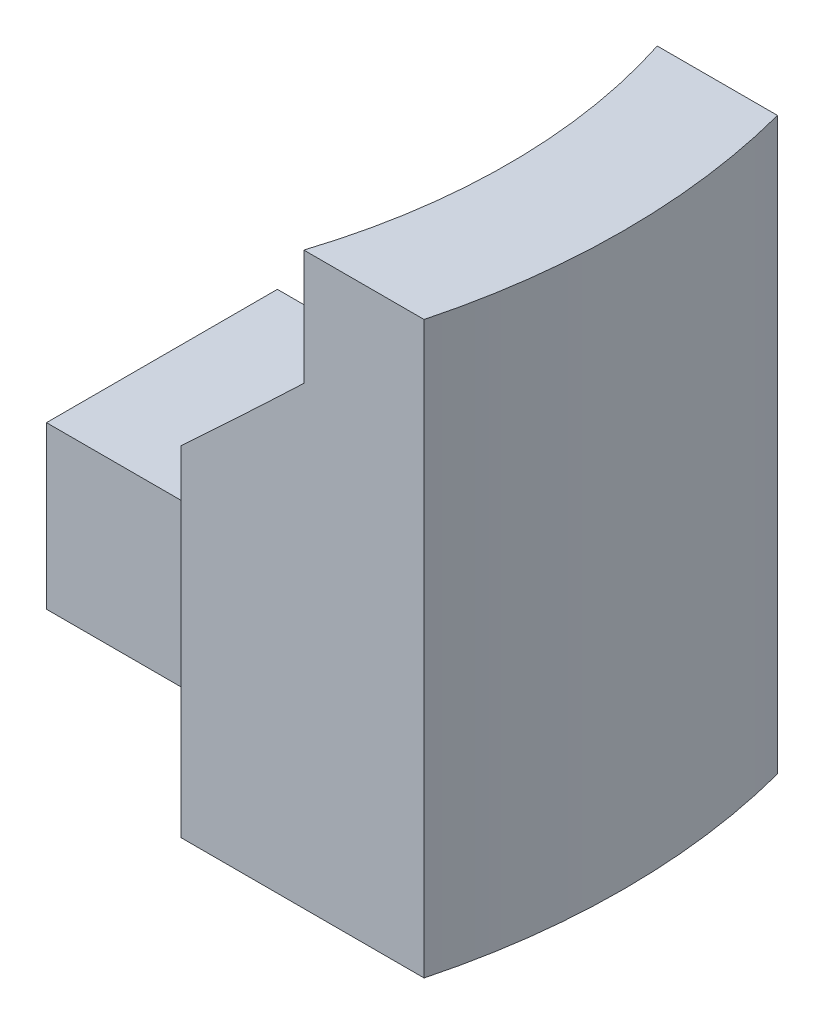
ISO-10303-21;
HEADER;
FILE_DESCRIPTION(('STEP AP214'),'2;1');
FILE_NAME('part.step','',(''),(''),'','','');
FILE_SCHEMA(('AUTOMOTIVE_DESIGN { 1 0 10303 214 1 1 1 1 }'));
ENDSEC;
DATA;
#1=APPLICATION_CONTEXT('core data for automotive mechanical design processes');
#2=APPLICATION_PROTOCOL_DEFINITION('international standard','automotive_design',2000,#1);
#3=PRODUCT_CONTEXT('',#1,'mechanical');
#4=PRODUCT('Part','Part','',(#3));
#5=PRODUCT_RELATED_PRODUCT_CATEGORY('part','',(#4));
#6=PRODUCT_DEFINITION_FORMATION('','',#4);
#7=PRODUCT_DEFINITION_CONTEXT('part definition',#1,'design');
#8=PRODUCT_DEFINITION('design','',#6,#7);
#9=PRODUCT_DEFINITION_SHAPE('','',#8);
#10=(LENGTH_UNIT() NAMED_UNIT(*) SI_UNIT(.MILLI.,.METRE.));
#11=(NAMED_UNIT(*) PLANE_ANGLE_UNIT() SI_UNIT($,.RADIAN.));
#12=(NAMED_UNIT(*) SI_UNIT($,.STERADIAN.) SOLID_ANGLE_UNIT());
#13=UNCERTAINTY_MEASURE_WITH_UNIT(LENGTH_MEASURE(1.E-05),#10,'distance_accuracy_value','');
#14=(GEOMETRIC_REPRESENTATION_CONTEXT(3) GLOBAL_UNCERTAINTY_ASSIGNED_CONTEXT((#13)) GLOBAL_UNIT_ASSIGNED_CONTEXT((#10,
#11,#12)) REPRESENTATION_CONTEXT('',''));
#15=CARTESIAN_POINT('',(0.,0.,0.));
#16=DIRECTION('',(0.,0.,1.));
#17=DIRECTION('',(1.,0.,0.));
#18=AXIS2_PLACEMENT_3D('',#15,#16,#17);
#19=CARTESIAN_POINT('',(-10.,0.,0.));
#20=DIRECTION('',(0.,-1.,0.));
#21=DIRECTION('',(0.,0.,-1.));
#22=AXIS2_PLACEMENT_3D('',#19,#20,#21);
#23=CYLINDRICAL_SURFACE('',#22,10.);
#24=DIRECTION('',(0.,-1.,0.));
#25=VECTOR('',#24,1.);
#26=CARTESIAN_POINT('',(-0.317541634481455,0.,2.5));
#27=LINE('',#26,#25);
#28=CARTESIAN_POINT('',(-0.317541634481455,1.5,2.5));
#29=VERTEX_POINT('',#28);
#30=CARTESIAN_POINT('',(-0.317541634481455,5.,2.5));
#31=VERTEX_POINT('',#30);
#32=EDGE_CURVE('E184',#29,#31,#27,.F.);
#33=ORIENTED_EDGE('',*,*,#32,.F.);
#34=CARTESIAN_POINT('',(-10.,-0.999999999999992,0.));
#35=DIRECTION('',(0.,0.707106781186549,-0.707106781186546));
#36=DIRECTION('',(0.,-0.707106781186546,-0.707106781186549));
#37=AXIS2_PLACEMENT_3D('',#34,#35,#36);
#38=ELLIPSE('',#37,14.1421356237309,10.);
#39=CARTESIAN_POINT('',(-0.0501256289337972,0.,0.999999999999996));
#40=VERTEX_POINT('',#39);
#41=EDGE_CURVE('E11',#29,#40,#38,.T.);
#42=ORIENTED_EDGE('',*,*,#41,.T.);
#43=CARTESIAN_POINT('',(-10.,0.,0.));
#44=DIRECTION('',(0.,-1.,0.));
#45=DIRECTION('',(0.,0.,-1.));
#46=AXIS2_PLACEMENT_3D('',#43,#44,#45);
#47=CIRCLE('',#46,10.);
#48=CARTESIAN_POINT('',(-0.761204674887133,0.,3.82683432365091));
#49=VERTEX_POINT('',#48);
#50=EDGE_CURVE('E248',#40,#49,#47,.T.);
#51=ORIENTED_EDGE('',*,*,#50,.T.);
#52=DIRECTION('',(0.,-1.,0.));
#53=VECTOR('',#52,1.);
#54=CARTESIAN_POINT('',(-0.761204674887134,7.35,3.82683432365091));
#55=LINE('',#54,#53);
#56=CARTESIAN_POINT('',(-0.761204674887134,7.35,3.82683432365091));
#57=VERTEX_POINT('',#56);
#58=EDGE_CURVE('E89',#57,#49,#55,.T.);
#59=ORIENTED_EDGE('',*,*,#58,.F.);
#60=CARTESIAN_POINT('',(-10.,7.35,0.));
#61=DIRECTION('',(0.,-1.,0.));
#62=DIRECTION('',(0.,0.,-1.));
#63=AXIS2_PLACEMENT_3D('',#60,#61,#62);
#64=CIRCLE('',#63,10.);
#65=CARTESIAN_POINT('',(-0.761204674887133,7.35,-3.82683432365091));
#66=VERTEX_POINT('',#65);
#67=EDGE_CURVE('E187',#66,#57,#64,.T.);
#68=ORIENTED_EDGE('',*,*,#67,.F.);
#69=DIRECTION('',(0.,-1.,0.));
#70=VECTOR('',#69,1.);
#71=CARTESIAN_POINT('',(-0.761204674887133,7.35,-3.82683432365091));
#72=LINE('',#71,#70);
#73=CARTESIAN_POINT('',(-0.761204674887132,0.,-3.82683432365091));
#74=VERTEX_POINT('',#73);
#75=EDGE_CURVE('E183',#66,#74,#72,.T.);
#76=ORIENTED_EDGE('',*,*,#75,.T.);
#77=CARTESIAN_POINT('',(-0.0501256289337972,0.,-1.));
#78=VERTEX_POINT('',#77);
#79=EDGE_CURVE('E249',#74,#78,#47,.T.);
#80=ORIENTED_EDGE('',*,*,#79,.T.);
#81=CARTESIAN_POINT('',(-10.,-1.,0.));
#82=DIRECTION('',(0.,0.707106781186546,0.707106781186549));
#83=DIRECTION('',(0.,-0.707106781186549,0.707106781186546));
#84=AXIS2_PLACEMENT_3D('',#81,#82,#83);
#85=ELLIPSE('',#84,14.142135623731,10.);
#86=CARTESIAN_POINT('',(-0.317541634481455,1.5,-2.5));
#87=VERTEX_POINT('',#86);
#88=EDGE_CURVE('E59',#78,#87,#85,.T.);
#89=ORIENTED_EDGE('',*,*,#88,.T.);
#90=DIRECTION('',(0.,-1.,0.));
#91=VECTOR('',#90,1.);
#92=CARTESIAN_POINT('',(-0.317541634481455,0.,-2.5));
#93=LINE('',#92,#91);
#94=CARTESIAN_POINT('',(-0.317541634481455,5.,-2.5));
#95=VERTEX_POINT('',#94);
#96=EDGE_CURVE('E148',#95,#87,#93,.T.);
#97=ORIENTED_EDGE('',*,*,#96,.F.);
#98=CARTESIAN_POINT('',(-10.,5.,0.));
#99=DIRECTION('',(0.,1.,0.));
#100=DIRECTION('',(0.,0.,1.));
#101=AXIS2_PLACEMENT_3D('',#98,#99,#100);
#102=CIRCLE('',#101,10.);
#103=EDGE_CURVE('E252',#31,#95,#102,.T.);
#104=ORIENTED_EDGE('',*,*,#103,.F.);
#105=EDGE_LOOP('',(#33,#42,#51,#59,#68,#76,#80,#89,#97,#104));
#106=FACE_BOUND('',#105,.T.);
#107=ADVANCED_FACE('F47',(#106),#23,.F.);
#108=CARTESIAN_POINT('',(-0.761204674887133,0.,-3.82683432365091));
#109=DIRECTION('',(0.,-1.,0.));
#110=DIRECTION('',(0.,0.,-1.));
#111=AXIS2_PLACEMENT_3D('',#108,#109,#110);
#112=PLANE('',#111);
#113=DIRECTION('',(-1.,0.,0.));
#114=VECTOR('',#113,1.);
#115=CARTESIAN_POINT('',(-0.761204674887134,0.,3.82683432365091));
#116=LINE('',#115,#114);
#117=CARTESIAN_POINT('',(4.50363192649786,0.,3.82683432365091));
#118=VERTEX_POINT('',#117);
#119=EDGE_CURVE('E52',#49,#118,#116,.F.);
#120=ORIENTED_EDGE('',*,*,#119,.F.);
#121=ORIENTED_EDGE('',*,*,#50,.F.);
#122=DIRECTION('',(-1.,0.,0.));
#123=VECTOR('',#122,1.);
#124=CARTESIAN_POINT('',(-0.761204674887133,0.,0.999999999999996));
#125=LINE('',#124,#123);
#126=CARTESIAN_POINT('',(-5.,0.,0.999999999999996));
#127=VERTEX_POINT('',#126);
#128=EDGE_CURVE('E256',#40,#127,#125,.T.);
#129=ORIENTED_EDGE('',*,*,#128,.T.);
#130=DIRECTION('',(0.,0.,-1.));
#131=VECTOR('',#130,1.);
#132=CARTESIAN_POINT('',(-5.,0.,-2.5));
#133=LINE('',#132,#131);
#134=CARTESIAN_POINT('',(-5.,0.,-1.));
#135=VERTEX_POINT('',#134);
#136=EDGE_CURVE('E166',#127,#135,#133,.T.);
#137=ORIENTED_EDGE('',*,*,#136,.T.);
#138=DIRECTION('',(1.,0.,0.));
#139=VECTOR('',#138,1.);
#140=CARTESIAN_POINT('',(-0.761204674887133,0.,-1.));
#141=LINE('',#140,#139);
#142=EDGE_CURVE('E154',#135,#78,#141,.T.);
#143=ORIENTED_EDGE('',*,*,#142,.T.);
#144=ORIENTED_EDGE('',*,*,#79,.F.);
#145=DIRECTION('',(1.,0.,0.));
#146=VECTOR('',#145,1.);
#147=CARTESIAN_POINT('',(-0.761204674887133,0.,-3.82683432365091));
#148=LINE('',#147,#146);
#149=CARTESIAN_POINT('',(4.50363192649786,0.,-3.82683432365091));
#150=VERTEX_POINT('',#149);
#151=EDGE_CURVE('E188',#150,#74,#148,.F.);
#152=ORIENTED_EDGE('',*,*,#151,.F.);
#153=CARTESIAN_POINT('',(-10.,0.,0.));
#154=DIRECTION('',(0.,-1.,0.));
#155=DIRECTION('',(0.,0.,-1.));
#156=AXIS2_PLACEMENT_3D('',#153,#154,#155);
#157=CIRCLE('',#156,15.);
#158=EDGE_CURVE('E244',#150,#118,#157,.T.);
#159=ORIENTED_EDGE('',*,*,#158,.T.);
#160=EDGE_LOOP('',(#120,#121,#129,#137,#143,#144,#152,#159));
#161=FACE_BOUND('',#160,.T.);
#162=ADVANCED_FACE('F261',(#161),#112,.T.);
#163=CARTESIAN_POINT('',(-10.,0.,0.));
#164=DIRECTION('',(0.,-1.,0.));
#165=DIRECTION('',(0.,0.,-1.));
#166=AXIS2_PLACEMENT_3D('',#163,#164,#165);
#167=CYLINDRICAL_SURFACE('',#166,15.);
#168=DIRECTION('',(0.,-1.,0.));
#169=VECTOR('',#168,1.);
#170=CARTESIAN_POINT('',(4.50363192649786,12.35,3.82683432365091));
#171=LINE('',#170,#169);
#172=CARTESIAN_POINT('',(4.50363192649786,12.35,3.82683432365091));
#173=VERTEX_POINT('',#172);
#174=EDGE_CURVE('E306',#173,#118,#171,.T.);
#175=ORIENTED_EDGE('',*,*,#174,.T.);
#176=ORIENTED_EDGE('',*,*,#158,.F.);
#177=DIRECTION('',(0.,-1.,0.));
#178=VECTOR('',#177,1.);
#179=CARTESIAN_POINT('',(4.50363192649786,12.35,-3.82683432365091));
#180=LINE('',#179,#178);
#181=CARTESIAN_POINT('',(4.50363192649786,12.35,-3.82683432365091));
#182=VERTEX_POINT('',#181);
#183=EDGE_CURVE('E483',#182,#150,#180,.T.);
#184=ORIENTED_EDGE('',*,*,#183,.F.);
#185=CARTESIAN_POINT('',(-10.,12.35,0.));
#186=DIRECTION('',(0.,-1.,0.));
#187=DIRECTION('',(0.,0.,-1.));
#188=AXIS2_PLACEMENT_3D('',#185,#186,#187);
#189=CIRCLE('',#188,15.);
#190=EDGE_CURVE('E240',#182,#173,#189,.T.);
#191=ORIENTED_EDGE('',*,*,#190,.T.);
#192=EDGE_LOOP('',(#175,#176,#184,#191));
#193=FACE_BOUND('',#192,.T.);
#194=ADVANCED_FACE('F290',(#193),#167,.T.);
#195=CARTESIAN_POINT('',(3.85819298766932,12.35,-5.74025148547637));
#196=DIRECTION('',(0.,1.,0.));
#197=DIRECTION('',(0.,0.,1.));
#198=AXIS2_PLACEMENT_3D('',#195,#196,#197);
#199=PLANE('',#198);
#200=DIRECTION('',(1.,0.,0.));
#201=VECTOR('',#200,1.);
#202=CARTESIAN_POINT('',(-0.761204674887134,12.35,3.82683432365091));
#203=LINE('',#202,#201);
#204=CARTESIAN_POINT('',(1.89980416054517,12.35,3.82683432365091));
#205=VERTEX_POINT('',#204);
#206=EDGE_CURVE('E98',#205,#173,#203,.T.);
#207=ORIENTED_EDGE('',*,*,#206,.T.);
#208=ORIENTED_EDGE('',*,*,#190,.F.);
#209=DIRECTION('',(-1.,0.,0.));
#210=VECTOR('',#209,1.);
#211=CARTESIAN_POINT('',(-0.761204674887133,12.35,-3.82683432365091));
#212=LINE('',#211,#210);
#213=CARTESIAN_POINT('',(1.89980416054516,12.35,-3.82683432365091));
#214=VERTEX_POINT('',#213);
#215=EDGE_CURVE('E307',#182,#214,#212,.T.);
#216=ORIENTED_EDGE('',*,*,#215,.T.);
#217=CARTESIAN_POINT('',(-10.,12.35,0.));
#218=DIRECTION('',(0.,-1.,0.));
#219=DIRECTION('',(0.,0.,-1.));
#220=AXIS2_PLACEMENT_3D('',#217,#218,#219);
#221=CIRCLE('',#220,12.5);
#222=EDGE_CURVE('E236',#214,#205,#221,.T.);
#223=ORIENTED_EDGE('',*,*,#222,.T.);
#224=EDGE_LOOP('',(#207,#208,#216,#223));
#225=FACE_BOUND('',#224,.T.);
#226=ADVANCED_FACE('F354',(#225),#199,.T.);
#227=CARTESIAN_POINT('',(-10.,0.,0.));
#228=DIRECTION('',(0.,-1.,0.));
#229=DIRECTION('',(0.,0.,-1.));
#230=AXIS2_PLACEMENT_3D('',#227,#228,#229);
#231=CYLINDRICAL_SURFACE('',#230,12.5);
#232=DIRECTION('',(0.,-1.,0.));
#233=VECTOR('',#232,1.);
#234=CARTESIAN_POINT('',(1.89980416054517,0.,3.82683432365091));
#235=LINE('',#234,#233);
#236=CARTESIAN_POINT('',(1.89980416054518,9.85,3.82683432365091));
#237=VERTEX_POINT('',#236);
#238=EDGE_CURVE('E305',#205,#237,#235,.T.);
#239=ORIENTED_EDGE('',*,*,#238,.F.);
#240=ORIENTED_EDGE('',*,*,#222,.F.);
#241=DIRECTION('',(0.,-1.,0.));
#242=VECTOR('',#241,1.);
#243=CARTESIAN_POINT('',(1.89980416054516,0.,-3.82683432365091));
#244=LINE('',#243,#242);
#245=CARTESIAN_POINT('',(1.89980416054517,9.85,-3.82683432365091));
#246=VERTEX_POINT('',#245);
#247=EDGE_CURVE('E191',#246,#214,#244,.F.);
#248=ORIENTED_EDGE('',*,*,#247,.F.);
#249=CARTESIAN_POINT('',(-10.,9.85,0.));
#250=DIRECTION('',(0.,-1.,0.));
#251=DIRECTION('',(0.,0.,-1.));
#252=AXIS2_PLACEMENT_3D('',#249,#250,#251);
#253=CIRCLE('',#252,12.5);
#254=EDGE_CURVE('E232',#246,#237,#253,.T.);
#255=ORIENTED_EDGE('',*,*,#254,.T.);
#256=EDGE_LOOP('',(#239,#240,#248,#255));
#257=FACE_BOUND('',#256,.T.);
#258=ADVANCED_FACE('F280',(#257),#231,.F.);
#259=CARTESIAN_POINT('',(-10.,9.85,0.));
#260=DIRECTION('',(0.,1.,0.));
#261=DIRECTION('',(0.,0.,1.));
#262=AXIS2_PLACEMENT_3D('',#259,#260,#261);
#263=CONICAL_SURFACE('',#262,12.5,0.785398163397454);
#264=CARTESIAN_POINT('',(6.16252547404509,13.9593916396666,3.82683432365091));
#265=CARTESIAN_POINT('',(5.71351867238026,13.5225061676968,3.82683432365091));
#266=CARTESIAN_POINT('',(5.26406683848158,13.0860760071235,3.82683432365091));
#267=CARTESIAN_POINT('',(4.3639251111091,12.2145212214988,3.82683432365091));
#268=CARTESIAN_POINT('',(3.91323525446139,11.7793965584027,3.82683432365091));
#269=CARTESIAN_POINT('',(3.01040316224258,10.9109758814241,3.82683432365091));
#270=CARTESIAN_POINT('',(2.55826149820528,10.4776792739445,3.82683432365091));
#271=CARTESIAN_POINT('',(1.65177925025837,9.6133568764946,3.82683432365091));
#272=CARTESIAN_POINT('',(1.19743858490213,9.18233117188829,3.82683432365091));
#273=CARTESIAN_POINT('',(0.285521198942474,8.32328665964471,3.82683432365091));
#274=CARTESIAN_POINT('',(-0.172056913131087,7.89526932520551,3.82683432365091));
#275=CARTESIAN_POINT('',(-0.861714824077965,7.25683851702016,3.82683432365091));
#276=CARTESIAN_POINT('',(-1.09213882279935,7.04463690169992,3.82683432365091));
#277=CARTESIAN_POINT('',(-1.55435587328608,6.62172253005921,3.82683432365091));
#278=CARTESIAN_POINT('',(-1.78614894254543,6.41100979283954,3.82683432365091));
#279=CARTESIAN_POINT('',(-2.25153052304747,5.99137198475371,3.82683432365091));
#280=CARTESIAN_POINT('',(-2.48511976260771,5.78244772047927,3.82683432365091));
#281=CARTESIAN_POINT('',(-2.95443475813243,5.36702693084916,3.82683432365091));
#282=CARTESIAN_POINT('',(-3.19016043595173,5.16053031732612,3.82683432365091));
#283=CARTESIAN_POINT('',(-3.664440647775,4.75065492267266,3.82683432365091));
#284=CARTESIAN_POINT('',(-3.9029960087972,4.54727709496604,3.82683432365091));
#285=CARTESIAN_POINT('',(-4.26355947306544,4.24544084252558,3.82683432365091));
#286=CARTESIAN_POINT('',(-4.38420995219386,4.1453610504949,3.82683432365091));
#287=CARTESIAN_POINT('',(-4.62657113856824,3.94648632013794,3.82683432365091));
#288=CARTESIAN_POINT('',(-4.74828187967211,3.8476914230959,3.82683432365091));
#289=CARTESIAN_POINT('',(-4.87059631455373,3.74964398298397,3.82683432365091));
#290=B_SPLINE_CURVE_WITH_KNOTS('',3,(#264,#265,#266,#267,#268,#269,#270,#271,#272,#273,#274,
#275,#276,#277,#278,#279,#280,#281,#282,#283,#284,#285,#286,#287,#288,#289),.UNSPECIFIED.,.F.,
.F.,(4,2,2,2,2,2,2,2,2,2,2,2,4),(0.,1.87943901516615,3.7588227173801,5.63754014925249,
7.51632770586487,9.39597885357117,10.3357199709361,11.2754731224199,12.215629859114,
13.1557523450718,14.0961567196926,14.5664173945175,15.0366931418841),.UNSPECIFIED.);
#291=EDGE_CURVE('E297',#237,#57,#290,.T.);
#292=ORIENTED_EDGE('',*,*,#291,.F.);
#293=ORIENTED_EDGE('',*,*,#254,.F.);
#294=CARTESIAN_POINT('',(-4.87059631455373,3.74964398298397,-3.82683432365091));
#295=CARTESIAN_POINT('',(-4.7484550318015,3.84755258088726,-3.82683432365091));
#296=CARTESIAN_POINT('',(-4.62691575797638,3.94620656131072,-3.82683432365091));
#297=CARTESIAN_POINT('',(-4.38489471129325,4.14479612431458,-3.82683432365091));
#298=CARTESIAN_POINT('',(-4.26441290477355,4.24473166584879,-3.82683432365091));
#299=CARTESIAN_POINT('',(-3.90435207262128,4.54613143703917,-3.82683432365091));
#300=CARTESIAN_POINT('',(-3.66612739689659,4.74921321383866,-3.82683432365091));
#301=CARTESIAN_POINT('',(-3.19250266473644,5.15849034701426,-3.82683432365091));
#302=CARTESIAN_POINT('',(-2.9571017839277,5.36468475293592,-3.82683432365091));
#303=CARTESIAN_POINT('',(-2.48843258701006,5.77949699921738,-3.82683432365091));
#304=CARTESIAN_POINT('',(-2.255164348725,5.98811492738994,-3.82683432365091));
#305=CARTESIAN_POINT('',(-1.79042198874541,6.40713751702734,-3.82683432365091));
#306=CARTESIAN_POINT('',(-1.55894714012032,6.61754137336063,-3.82683432365091));
#307=CARTESIAN_POINT('',(-1.09736470486199,7.03983615044775,-3.82683432365091));
#308=CARTESIAN_POINT('',(-0.867257100799956,7.25172705217021,-3.82683432365091));
#309=CARTESIAN_POINT('',(-0.178546604984652,7.88922378788951,-3.82683432365091));
#310=CARTESIAN_POINT('',(0.278402344928255,8.31661591655139,-3.82683432365091));
#311=CARTESIAN_POINT('',(1.19035453603919,9.17562325453614,-3.82683432365091));
#312=CARTESIAN_POINT('',(1.64535058428962,9.6072460799384,-3.82683432365091));
#313=CARTESIAN_POINT('',(2.5531345964955,10.4727722178353,-3.82683432365091));
#314=CARTESIAN_POINT('',(3.00592264214867,10.9066754447,-3.82683432365091));
#315=CARTESIAN_POINT('',(3.91004236689926,11.7763161054299,-3.82683432365091));
#316=CARTESIAN_POINT('',(4.3613734707341,12.212054136777,-3.82683432365091));
#317=CARTESIAN_POINT('',(5.26279361851154,13.0848398153054,-3.82683432365091));
#318=CARTESIAN_POINT('',(5.71288262565034,13.5218875005087,-3.82683432365091));
#319=CARTESIAN_POINT('',(6.1625254740451,13.9593916396666,-3.82683432365091));
#320=B_SPLINE_CURVE_WITH_KNOTS('',3,(#294,#295,#296,#297,#298,#299,#300,#301,#302,#303,#304,
#305,#306,#307,#308,#309,#310,#311,#312,#313,#314,#315,#316,#317,#318,#319),.UNSPECIFIED.,.F.,
.F.,(4,2,2,2,2,2,2,2,2,2,2,2,4),(0.,0.469609954836376,0.939204906259214,1.87827826457438,
2.81707045143668,3.75589676080305,4.69432020444799,5.63273165987191,7.50972311407051,
9.39116987433823,11.2725464832777,13.154592239827,15.0366931758942),.UNSPECIFIED.);
#321=EDGE_CURVE('E199',#66,#246,#320,.T.);
#322=ORIENTED_EDGE('',*,*,#321,.F.);
#323=ORIENTED_EDGE('',*,*,#67,.T.);
#324=EDGE_LOOP('',(#292,#293,#322,#323));
#325=FACE_BOUND('',#324,.T.);
#326=ADVANCED_FACE('F272',(#325),#263,.F.);
#327=CARTESIAN_POINT('',(-5.,5.,-2.5));
#328=DIRECTION('',(0.,1.,0.));
#329=DIRECTION('',(0.,0.,1.));
#330=AXIS2_PLACEMENT_3D('',#327,#328,#329);
#331=PLANE('',#330);
#332=DIRECTION('',(1.,0.,0.));
#333=VECTOR('',#332,1.);
#334=CARTESIAN_POINT('',(-5.,5.,2.5));
#335=LINE('',#334,#333);
#336=CARTESIAN_POINT('',(-5.,5.,2.5));
#337=VERTEX_POINT('',#336);
#338=EDGE_CURVE('E219',#337,#31,#335,.T.);
#339=ORIENTED_EDGE('',*,*,#338,.T.);
#340=ORIENTED_EDGE('',*,*,#103,.T.);
#341=DIRECTION('',(1.,0.,0.));
#342=VECTOR('',#341,1.);
#343=CARTESIAN_POINT('',(-5.,5.,-2.5));
#344=LINE('',#343,#342);
#345=CARTESIAN_POINT('',(-5.,5.,-2.5));
#346=VERTEX_POINT('',#345);
#347=EDGE_CURVE('E218',#346,#95,#344,.T.);
#348=ORIENTED_EDGE('',*,*,#347,.F.);
#349=DIRECTION('',(0.,0.,1.));
#350=VECTOR('',#349,1.);
#351=CARTESIAN_POINT('',(-5.,5.,-2.5));
#352=LINE('',#351,#350);
#353=EDGE_CURVE('E164',#346,#337,#352,.T.);
#354=ORIENTED_EDGE('',*,*,#353,.T.);
#355=EDGE_LOOP('',(#339,#340,#348,#354));
#356=FACE_BOUND('',#355,.T.);
#357=ADVANCED_FACE('F270',(#356),#331,.T.);
#358=CARTESIAN_POINT('',(-5.,0.,2.5));
#359=DIRECTION('',(0.,0.,1.));
#360=DIRECTION('',(0.,-1.,0.));
#361=AXIS2_PLACEMENT_3D('',#358,#359,#360);
#362=PLANE('',#361);
#363=DIRECTION('',(0.,-1.,0.));
#364=VECTOR('',#363,1.);
#365=CARTESIAN_POINT('',(-5.,0.,2.5));
#366=LINE('',#365,#364);
#367=CARTESIAN_POINT('',(-5.,1.5,2.5));
#368=VERTEX_POINT('',#367);
#369=EDGE_CURVE('E190',#337,#368,#366,.T.);
#370=ORIENTED_EDGE('',*,*,#369,.T.);
#371=DIRECTION('',(1.,0.,0.));
#372=VECTOR('',#371,1.);
#373=CARTESIAN_POINT('',(-5.,1.5,2.5));
#374=LINE('',#373,#372);
#375=EDGE_CURVE('E172',#368,#29,#374,.T.);
#376=ORIENTED_EDGE('',*,*,#375,.T.);
#377=ORIENTED_EDGE('',*,*,#32,.T.);
#378=ORIENTED_EDGE('',*,*,#338,.F.);
#379=EDGE_LOOP('',(#370,#376,#377,#378));
#380=FACE_BOUND('',#379,.T.);
#381=ADVANCED_FACE('F265',(#380),#362,.T.);
#382=CARTESIAN_POINT('',(-5.,0.,-2.5));
#383=DIRECTION('',(0.,0.,-1.));
#384=DIRECTION('',(0.,1.,0.));
#385=AXIS2_PLACEMENT_3D('',#382,#383,#384);
#386=PLANE('',#385);
#387=ORIENTED_EDGE('',*,*,#96,.T.);
#388=DIRECTION('',(-1.,0.,0.));
#389=VECTOR('',#388,1.);
#390=CARTESIAN_POINT('',(-5.,1.5,-2.5));
#391=LINE('',#390,#389);
#392=CARTESIAN_POINT('',(-5.,1.5,-2.5));
#393=VERTEX_POINT('',#392);
#394=EDGE_CURVE('E142',#87,#393,#391,.T.);
#395=ORIENTED_EDGE('',*,*,#394,.T.);
#396=DIRECTION('',(0.,1.,0.));
#397=VECTOR('',#396,1.);
#398=CARTESIAN_POINT('',(-5.,0.,-2.5));
#399=LINE('',#398,#397);
#400=EDGE_CURVE('E146',#393,#346,#399,.T.);
#401=ORIENTED_EDGE('',*,*,#400,.T.);
#402=ORIENTED_EDGE('',*,*,#347,.T.);
#403=EDGE_LOOP('',(#387,#395,#401,#402));
#404=FACE_BOUND('',#403,.T.);
#405=ADVANCED_FACE('F144',(#404),#386,.T.);
#406=CARTESIAN_POINT('',(-5.,0.,0.));
#407=DIRECTION('',(1.,0.,0.));
#408=DIRECTION('',(0.,0.,-1.));
#409=AXIS2_PLACEMENT_3D('',#406,#407,#408);
#410=PLANE('',#409);
#411=ORIENTED_EDGE('',*,*,#400,.F.);
#412=DIRECTION('',(0.,0.707106781186549,-0.707106781186546));
#413=VECTOR('',#412,1.);
#414=CARTESIAN_POINT('',(-5.,0.,-1.));
#415=LINE('',#414,#413);
#416=EDGE_CURVE('E160',#393,#135,#415,.F.);
#417=ORIENTED_EDGE('',*,*,#416,.T.);
#418=ORIENTED_EDGE('',*,*,#136,.F.);
#419=DIRECTION('',(0.,-0.707106781186546,-0.707106781186549));
#420=VECTOR('',#419,1.);
#421=CARTESIAN_POINT('',(-5.,1.5,2.5));
#422=LINE('',#421,#420);
#423=EDGE_CURVE('E153',#127,#368,#422,.F.);
#424=ORIENTED_EDGE('',*,*,#423,.T.);
#425=ORIENTED_EDGE('',*,*,#369,.F.);
#426=ORIENTED_EDGE('',*,*,#353,.F.);
#427=EDGE_LOOP('',(#411,#417,#418,#424,#425,#426));
#428=FACE_BOUND('',#427,.T.);
#429=ADVANCED_FACE('F158',(#428),#410,.F.);
#430=CARTESIAN_POINT('',(-0.761204674887133,0.,-1.));
#431=DIRECTION('',(0.,0.707106781186546,0.707106781186549));
#432=DIRECTION('',(1.,0.,0.));
#433=AXIS2_PLACEMENT_3D('',#430,#431,#432);
#434=PLANE('',#433);
#435=ORIENTED_EDGE('',*,*,#416,.F.);
#436=ORIENTED_EDGE('',*,*,#394,.F.);
#437=ORIENTED_EDGE('',*,*,#88,.F.);
#438=ORIENTED_EDGE('',*,*,#142,.F.);
#439=EDGE_LOOP('',(#435,#436,#437,#438));
#440=FACE_BOUND('',#439,.T.);
#441=ADVANCED_FACE('F169',(#440),#434,.F.);
#442=CARTESIAN_POINT('',(-5.,1.5,2.5));
#443=DIRECTION('',(0.,0.707106781186549,-0.707106781186546));
#444=DIRECTION('',(1.,0.,0.));
#445=AXIS2_PLACEMENT_3D('',#442,#443,#444);
#446=PLANE('',#445);
#447=ORIENTED_EDGE('',*,*,#423,.F.);
#448=ORIENTED_EDGE('',*,*,#128,.F.);
#449=ORIENTED_EDGE('',*,*,#41,.F.);
#450=ORIENTED_EDGE('',*,*,#375,.F.);
#451=EDGE_LOOP('',(#447,#448,#449,#450));
#452=FACE_BOUND('',#451,.T.);
#453=ADVANCED_FACE('F50',(#452),#446,.F.);
#454=CARTESIAN_POINT('',(-0.761204674887134,12.35,3.82683432365091));
#455=DIRECTION('',(0.,0.,-1.));
#456=DIRECTION('',(-1.,0.,0.));
#457=AXIS2_PLACEMENT_3D('',#454,#455,#456);
#458=PLANE('',#457);
#459=ORIENTED_EDGE('',*,*,#119,.T.);
#460=ORIENTED_EDGE('',*,*,#174,.F.);
#461=ORIENTED_EDGE('',*,*,#206,.F.);
#462=ORIENTED_EDGE('',*,*,#238,.T.);
#463=ORIENTED_EDGE('',*,*,#291,.T.);
#464=ORIENTED_EDGE('',*,*,#58,.T.);
#465=EDGE_LOOP('',(#459,#460,#461,#462,#463,#464));
#466=FACE_BOUND('',#465,.T.);
#467=ADVANCED_FACE('F309',(#466),#458,.F.);
#468=CARTESIAN_POINT('',(-0.761204674887133,12.35,-3.82683432365091));
#469=DIRECTION('',(0.,0.,1.));
#470=DIRECTION('',(1.,0.,0.));
#471=AXIS2_PLACEMENT_3D('',#468,#469,#470);
#472=PLANE('',#471);
#473=ORIENTED_EDGE('',*,*,#151,.T.);
#474=ORIENTED_EDGE('',*,*,#75,.F.);
#475=ORIENTED_EDGE('',*,*,#321,.T.);
#476=ORIENTED_EDGE('',*,*,#247,.T.);
#477=ORIENTED_EDGE('',*,*,#215,.F.);
#478=ORIENTED_EDGE('',*,*,#183,.T.);
#479=EDGE_LOOP('',(#473,#474,#475,#476,#477,#478));
#480=FACE_BOUND('',#479,.T.);
#481=ADVANCED_FACE('F312',(#480),#472,.F.);
#482=CLOSED_SHELL('',(#107,#162,#194,#226,#258,#326,#357,#381,#405,#429,#441,#453,#467,#481));
#483=MANIFOLD_SOLID_BREP('B2',#482);
#484=ADVANCED_BREP_SHAPE_REPRESENTATION('',(#18,#483),#14);
#485=SHAPE_DEFINITION_REPRESENTATION(#9,#484);
ENDSEC;
END-ISO-10303-21;
